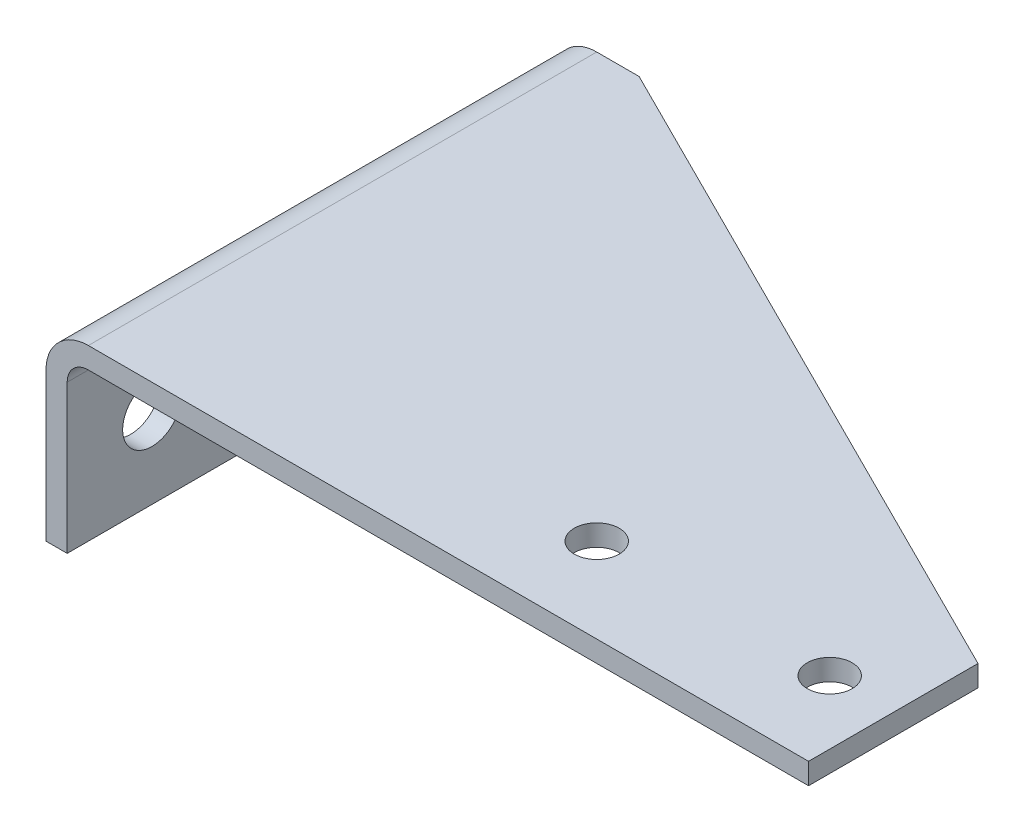
ISO-10303-21;
HEADER;
FILE_DESCRIPTION(('STEP AP214'),'2;1');
FILE_NAME('part.step','',(''),(''),'','','');
FILE_SCHEMA(('AUTOMOTIVE_DESIGN { 1 0 10303 214 1 1 1 1 }'));
ENDSEC;
DATA;
#1=APPLICATION_CONTEXT('core data for automotive mechanical design processes');
#2=APPLICATION_PROTOCOL_DEFINITION('international standard','automotive_design',2000,#1);
#3=PRODUCT_CONTEXT('',#1,'mechanical');
#4=PRODUCT('Part','Part','',(#3));
#5=PRODUCT_RELATED_PRODUCT_CATEGORY('part','',(#4));
#6=PRODUCT_DEFINITION_FORMATION('','',#4);
#7=PRODUCT_DEFINITION_CONTEXT('part definition',#1,'design');
#8=PRODUCT_DEFINITION('design','',#6,#7);
#9=PRODUCT_DEFINITION_SHAPE('','',#8);
#10=(LENGTH_UNIT() NAMED_UNIT(*) SI_UNIT(.MILLI.,.METRE.));
#11=(NAMED_UNIT(*) PLANE_ANGLE_UNIT() SI_UNIT($,.RADIAN.));
#12=(NAMED_UNIT(*) SI_UNIT($,.STERADIAN.) SOLID_ANGLE_UNIT());
#13=UNCERTAINTY_MEASURE_WITH_UNIT(LENGTH_MEASURE(1.E-05),#10,'distance_accuracy_value','');
#14=(GEOMETRIC_REPRESENTATION_CONTEXT(3) GLOBAL_UNCERTAINTY_ASSIGNED_CONTEXT((#13)) GLOBAL_UNIT_ASSIGNED_CONTEXT((#10,
#11,#12)) REPRESENTATION_CONTEXT('',''));
#15=CARTESIAN_POINT('',(0.,0.,0.));
#16=DIRECTION('',(0.,0.,1.));
#17=DIRECTION('',(1.,0.,0.));
#18=AXIS2_PLACEMENT_3D('',#15,#16,#17);
#19=CARTESIAN_POINT('',(6.34999999999998,-57.15,-127.));
#20=DIRECTION('',(1.,0.,0.));
#21=DIRECTION('',(0.,0.,-1.));
#22=AXIS2_PLACEMENT_3D('',#19,#20,#21);
#23=PLANE('',#22);
#24=CARTESIAN_POINT('',(6.34999999999997,-33.3375,0.));
#25=DIRECTION('',(1.,0.,0.));
#26=DIRECTION('',(0.,0.,-1.));
#27=AXIS2_PLACEMENT_3D('',#24,#25,#26);
#28=CIRCLE('',#27,8.763);
#29=CARTESIAN_POINT('',(6.34999999999997,-33.3375,-8.763));
#30=VERTEX_POINT('',#29);
#31=EDGE_CURVE('E149',#30,#30,#28,.F.);
#32=ORIENTED_EDGE('',*,*,#31,.T.);
#33=EDGE_LOOP('',(#32));
#34=FACE_BOUND('',#33,.T.);
#35=CARTESIAN_POINT('',(6.34999999999997,-33.3375,-101.6));
#36=DIRECTION('',(1.,0.,0.));
#37=DIRECTION('',(0.,0.,-1.));
#38=AXIS2_PLACEMENT_3D('',#35,#36,#37);
#39=CIRCLE('',#38,8.76299999999999);
#40=CARTESIAN_POINT('',(6.34999999999997,-33.3375,-110.363));
#41=VERTEX_POINT('',#40);
#42=EDGE_CURVE('E213',#41,#41,#39,.F.);
#43=ORIENTED_EDGE('',*,*,#42,.T.);
#44=EDGE_LOOP('',(#43));
#45=FACE_BOUND('',#44,.T.);
#46=DIRECTION('',(0.,0.,1.));
#47=VECTOR('',#46,1.);
#48=CARTESIAN_POINT('',(6.34999999999998,-12.7,-127.));
#49=LINE('',#48,#47);
#50=CARTESIAN_POINT('',(6.34999999999998,-12.7,-127.));
#51=VERTEX_POINT('',#50);
#52=CARTESIAN_POINT('',(6.34999999999998,-12.7,25.4000000000001));
#53=VERTEX_POINT('',#52);
#54=EDGE_CURVE('E174',#51,#53,#49,.T.);
#55=ORIENTED_EDGE('',*,*,#54,.T.);
#56=DIRECTION('',(0.,-1.,0.));
#57=VECTOR('',#56,1.);
#58=CARTESIAN_POINT('',(6.34999999999998,-57.15,25.4000000000001));
#59=LINE('',#58,#57);
#60=CARTESIAN_POINT('',(6.34999999999998,-57.15,25.4000000000001));
#61=VERTEX_POINT('',#60);
#62=EDGE_CURVE('E201',#53,#61,#59,.T.);
#63=ORIENTED_EDGE('',*,*,#62,.T.);
#64=DIRECTION('',(0.,0.,1.));
#65=VECTOR('',#64,1.);
#66=CARTESIAN_POINT('',(6.34999999999998,-57.15,-127.));
#67=LINE('',#66,#65);
#68=CARTESIAN_POINT('',(6.34999999999998,-57.15,-127.));
#69=VERTEX_POINT('',#68);
#70=EDGE_CURVE('E177',#69,#61,#67,.T.);
#71=ORIENTED_EDGE('',*,*,#70,.F.);
#72=DIRECTION('',(0.,1.,0.));
#73=VECTOR('',#72,1.);
#74=CARTESIAN_POINT('',(6.34999999999998,-57.15,-127.));
#75=LINE('',#74,#73);
#76=EDGE_CURVE('E168',#69,#51,#75,.T.);
#77=ORIENTED_EDGE('',*,*,#76,.T.);
#78=EDGE_LOOP('',(#55,#63,#71,#77));
#79=FACE_BOUND('',#78,.T.);
#80=ADVANCED_FACE('F32',(#34,#45,#79),#23,.T.);
#81=CARTESIAN_POINT('',(0.,-12.7,-127.));
#82=DIRECTION('',(-1.,0.,0.));
#83=DIRECTION('',(0.,-1.,0.));
#84=AXIS2_PLACEMENT_3D('',#81,#82,#83);
#85=PLANE('',#84);
#86=CARTESIAN_POINT('',(0.,-33.3375,0.));
#87=DIRECTION('',(1.,0.,0.));
#88=DIRECTION('',(0.,0.,-1.));
#89=AXIS2_PLACEMENT_3D('',#86,#87,#88);
#90=CIRCLE('',#89,8.763);
#91=CARTESIAN_POINT('',(0.,-33.3375,-8.763));
#92=VERTEX_POINT('',#91);
#93=EDGE_CURVE('E215',#92,#92,#90,.T.);
#94=ORIENTED_EDGE('',*,*,#93,.T.);
#95=EDGE_LOOP('',(#94));
#96=FACE_BOUND('',#95,.T.);
#97=CARTESIAN_POINT('',(0.,-33.3375,-101.6));
#98=DIRECTION('',(1.,0.,0.));
#99=DIRECTION('',(0.,0.,-1.));
#100=AXIS2_PLACEMENT_3D('',#97,#98,#99);
#101=CIRCLE('',#100,8.76299999999999);
#102=CARTESIAN_POINT('',(0.,-33.3375,-110.363));
#103=VERTEX_POINT('',#102);
#104=EDGE_CURVE('E210',#103,#103,#101,.T.);
#105=ORIENTED_EDGE('',*,*,#104,.T.);
#106=EDGE_LOOP('',(#105));
#107=FACE_BOUND('',#106,.T.);
#108=DIRECTION('',(0.,0.,1.));
#109=VECTOR('',#108,1.);
#110=CARTESIAN_POINT('',(0.,-57.15,-127.));
#111=LINE('',#110,#109);
#112=CARTESIAN_POINT('',(0.,-57.15,-127.));
#113=VERTEX_POINT('',#112);
#114=CARTESIAN_POINT('',(0.,-57.15,25.4));
#115=VERTEX_POINT('',#114);
#116=EDGE_CURVE('E180',#113,#115,#111,.T.);
#117=ORIENTED_EDGE('',*,*,#116,.T.);
#118=DIRECTION('',(0.,-1.,0.));
#119=VECTOR('',#118,1.);
#120=CARTESIAN_POINT('',(0.,504.522513486094,25.4));
#121=LINE('',#120,#119);
#122=CARTESIAN_POINT('',(0.,-12.7,25.4000000000001));
#123=VERTEX_POINT('',#122);
#124=EDGE_CURVE('E190',#123,#115,#121,.T.);
#125=ORIENTED_EDGE('',*,*,#124,.F.);
#126=DIRECTION('',(0.,0.,1.));
#127=VECTOR('',#126,1.);
#128=CARTESIAN_POINT('',(0.,-12.7,-127.));
#129=LINE('',#128,#127);
#130=CARTESIAN_POINT('',(0.,-12.7,-127.));
#131=VERTEX_POINT('',#130);
#132=EDGE_CURVE('E132',#131,#123,#129,.T.);
#133=ORIENTED_EDGE('',*,*,#132,.F.);
#134=DIRECTION('',(0.,-1.,0.));
#135=VECTOR('',#134,1.);
#136=CARTESIAN_POINT('',(0.,-12.7,-127.));
#137=LINE('',#136,#135);
#138=EDGE_CURVE('E162',#131,#113,#137,.T.);
#139=ORIENTED_EDGE('',*,*,#138,.T.);
#140=EDGE_LOOP('',(#117,#125,#133,#139));
#141=FACE_BOUND('',#140,.T.);
#142=ADVANCED_FACE('F189',(#96,#107,#141),#85,.T.);
#143=CARTESIAN_POINT('',(12.7,-6.35,-127.));
#144=DIRECTION('',(0.,-1.,0.));
#145=DIRECTION('',(1.,0.,0.));
#146=AXIS2_PLACEMENT_3D('',#143,#144,#145);
#147=PLANE('',#146);
#148=CARTESIAN_POINT('',(139.7,-6.34999999999997,0.));
#149=DIRECTION('',(0.,-1.,0.));
#150=DIRECTION('',(1.,0.,0.));
#151=AXIS2_PLACEMENT_3D('',#148,#149,#150);
#152=CIRCLE('',#151,6.73099999999998);
#153=CARTESIAN_POINT('',(146.431,-6.34999999999997,0.));
#154=VERTEX_POINT('',#153);
#155=EDGE_CURVE('E139',#154,#154,#152,.F.);
#156=ORIENTED_EDGE('',*,*,#155,.T.);
#157=EDGE_LOOP('',(#156));
#158=FACE_BOUND('',#157,.T.);
#159=CARTESIAN_POINT('',(209.55,-6.34999999999997,0.));
#160=DIRECTION('',(0.,-1.,0.));
#161=DIRECTION('',(1.,0.,0.));
#162=AXIS2_PLACEMENT_3D('',#159,#160,#161);
#163=CIRCLE('',#162,6.73099999999998);
#164=CARTESIAN_POINT('',(216.281,-6.34999999999997,0.));
#165=VERTEX_POINT('',#164);
#166=EDGE_CURVE('E116',#165,#165,#163,.F.);
#167=ORIENTED_EDGE('',*,*,#166,.T.);
#168=EDGE_LOOP('',(#167));
#169=FACE_BOUND('',#168,.T.);
#170=DIRECTION('',(0.,0.,1.));
#171=VECTOR('',#170,1.);
#172=CARTESIAN_POINT('',(228.6,-6.34999999999999,-127.));
#173=LINE('',#172,#171);
#174=CARTESIAN_POINT('',(228.6,-6.34999999999997,-25.4));
#175=VERTEX_POINT('',#174);
#176=CARTESIAN_POINT('',(228.6,-6.34999999999997,25.4));
#177=VERTEX_POINT('',#176);
#178=EDGE_CURVE('E41',#175,#177,#173,.T.);
#179=ORIENTED_EDGE('',*,*,#178,.T.);
#180=DIRECTION('',(-1.,0.,0.));
#181=VECTOR('',#180,1.);
#182=CARTESIAN_POINT('',(12.7,-6.35,25.4000000000001));
#183=LINE('',#182,#181);
#184=CARTESIAN_POINT('',(12.7,-6.35,25.4000000000001));
#185=VERTEX_POINT('',#184);
#186=EDGE_CURVE('E110',#177,#185,#183,.T.);
#187=ORIENTED_EDGE('',*,*,#186,.T.);
#188=DIRECTION('',(0.,0.,1.));
#189=VECTOR('',#188,1.);
#190=CARTESIAN_POINT('',(12.7,-6.35,-127.));
#191=LINE('',#190,#189);
#192=CARTESIAN_POINT('',(12.7,-6.35,-127.));
#193=VERTEX_POINT('',#192);
#194=EDGE_CURVE('E56',#193,#185,#191,.T.);
#195=ORIENTED_EDGE('',*,*,#194,.F.);
#196=DIRECTION('',(1.,0.,0.));
#197=VECTOR('',#196,1.);
#198=CARTESIAN_POINT('',(12.7,-6.35,-127.));
#199=LINE('',#198,#197);
#200=CARTESIAN_POINT('',(25.4,-6.35,-127.));
#201=VERTEX_POINT('',#200);
#202=EDGE_CURVE('E130',#193,#201,#199,.T.);
#203=ORIENTED_EDGE('',*,*,#202,.T.);
#204=DIRECTION('',(0.894427190999916,0.,0.447213595499958));
#205=VECTOR('',#204,1.);
#206=CARTESIAN_POINT('',(15.24,-6.35,-132.08));
#207=LINE('',#206,#205);
#208=EDGE_CURVE('E48',#201,#175,#207,.T.);
#209=ORIENTED_EDGE('',*,*,#208,.T.);
#210=EDGE_LOOP('',(#179,#187,#195,#203,#209));
#211=FACE_BOUND('',#210,.T.);
#212=ADVANCED_FACE('F244',(#158,#169,#211),#147,.T.);
#213=CARTESIAN_POINT('',(228.6,0.,-127.));
#214=DIRECTION('',(0.,1.,0.));
#215=DIRECTION('',(-1.,0.,0.));
#216=AXIS2_PLACEMENT_3D('',#213,#214,#215);
#217=PLANE('',#216);
#218=CARTESIAN_POINT('',(139.7,0.,0.));
#219=DIRECTION('',(0.,1.,0.));
#220=DIRECTION('',(-1.,0.,0.));
#221=AXIS2_PLACEMENT_3D('',#218,#219,#220);
#222=CIRCLE('',#221,6.73099999999998);
#223=CARTESIAN_POINT('',(132.969,0.,0.));
#224=VERTEX_POINT('',#223);
#225=EDGE_CURVE('E36',#224,#224,#222,.F.);
#226=ORIENTED_EDGE('',*,*,#225,.T.);
#227=EDGE_LOOP('',(#226));
#228=FACE_BOUND('',#227,.T.);
#229=CARTESIAN_POINT('',(209.55,0.,0.));
#230=DIRECTION('',(0.,1.,0.));
#231=DIRECTION('',(-1.,0.,0.));
#232=AXIS2_PLACEMENT_3D('',#229,#230,#231);
#233=CIRCLE('',#232,6.73099999999998);
#234=CARTESIAN_POINT('',(202.819,0.,0.));
#235=VERTEX_POINT('',#234);
#236=EDGE_CURVE('E137',#235,#235,#233,.F.);
#237=ORIENTED_EDGE('',*,*,#236,.T.);
#238=EDGE_LOOP('',(#237));
#239=FACE_BOUND('',#238,.T.);
#240=DIRECTION('',(0.,0.,1.));
#241=VECTOR('',#240,1.);
#242=CARTESIAN_POINT('',(12.7,0.,-127.));
#243=LINE('',#242,#241);
#244=CARTESIAN_POINT('',(12.7,0.,-127.));
#245=VERTEX_POINT('',#244);
#246=CARTESIAN_POINT('',(12.7,0.,25.4000000000001));
#247=VERTEX_POINT('',#246);
#248=EDGE_CURVE('E125',#245,#247,#243,.T.);
#249=ORIENTED_EDGE('',*,*,#248,.T.);
#250=DIRECTION('',(1.,0.,0.));
#251=VECTOR('',#250,1.);
#252=CARTESIAN_POINT('',(228.6,0.,25.4));
#253=LINE('',#252,#251);
#254=CARTESIAN_POINT('',(228.6,0.,25.4));
#255=VERTEX_POINT('',#254);
#256=EDGE_CURVE('E108',#247,#255,#253,.T.);
#257=ORIENTED_EDGE('',*,*,#256,.T.);
#258=DIRECTION('',(0.,0.,1.));
#259=VECTOR('',#258,1.);
#260=CARTESIAN_POINT('',(228.6,0.,-127.));
#261=LINE('',#260,#259);
#262=CARTESIAN_POINT('',(228.6,0.,-25.4));
#263=VERTEX_POINT('',#262);
#264=EDGE_CURVE('E123',#263,#255,#261,.T.);
#265=ORIENTED_EDGE('',*,*,#264,.F.);
#266=DIRECTION('',(-0.894427190999916,0.,-0.447213595499958));
#267=VECTOR('',#266,1.);
#268=CARTESIAN_POINT('',(187.96,0.,-45.72));
#269=LINE('',#268,#267);
#270=CARTESIAN_POINT('',(25.4,0.,-127.));
#271=VERTEX_POINT('',#270);
#272=EDGE_CURVE('E154',#263,#271,#269,.T.);
#273=ORIENTED_EDGE('',*,*,#272,.T.);
#274=DIRECTION('',(-1.,0.,0.));
#275=VECTOR('',#274,1.);
#276=CARTESIAN_POINT('',(228.6,0.,-127.));
#277=LINE('',#276,#275);
#278=EDGE_CURVE('E157',#271,#245,#277,.T.);
#279=ORIENTED_EDGE('',*,*,#278,.T.);
#280=EDGE_LOOP('',(#249,#257,#265,#273,#279));
#281=FACE_BOUND('',#280,.T.);
#282=ADVANCED_FACE('F121',(#228,#239,#281),#217,.T.);
#283=CARTESIAN_POINT('',(12.7,-12.7,-127.));
#284=DIRECTION('',(0.,0.,1.));
#285=DIRECTION('',(1.,0.,0.));
#286=AXIS2_PLACEMENT_3D('',#283,#284,#285);
#287=CYLINDRICAL_SURFACE('',#286,6.35);
#288=ORIENTED_EDGE('',*,*,#194,.T.);
#289=CARTESIAN_POINT('',(12.7,-12.7,25.4000000000001));
#290=DIRECTION('',(0.,0.,1.));
#291=DIRECTION('',(1.,0.,0.));
#292=AXIS2_PLACEMENT_3D('',#289,#290,#291);
#293=CIRCLE('',#292,6.35);
#294=EDGE_CURVE('E203',#185,#53,#293,.T.);
#295=ORIENTED_EDGE('',*,*,#294,.T.);
#296=ORIENTED_EDGE('',*,*,#54,.F.);
#297=CARTESIAN_POINT('',(12.7,-12.7,-127.));
#298=DIRECTION('',(0.,0.,-1.));
#299=DIRECTION('',(-1.,0.,0.));
#300=AXIS2_PLACEMENT_3D('',#297,#298,#299);
#301=CIRCLE('',#300,6.35);
#302=EDGE_CURVE('E134',#51,#193,#301,.T.);
#303=ORIENTED_EDGE('',*,*,#302,.T.);
#304=EDGE_LOOP('',(#288,#295,#296,#303));
#305=FACE_BOUND('',#304,.T.);
#306=ADVANCED_FACE('F248',(#305),#287,.F.);
#307=CARTESIAN_POINT('',(0.,-57.15,-127.));
#308=DIRECTION('',(0.,-1.,0.));
#309=DIRECTION('',(0.,0.,-1.));
#310=AXIS2_PLACEMENT_3D('',#307,#308,#309);
#311=PLANE('',#310);
#312=ORIENTED_EDGE('',*,*,#70,.T.);
#313=DIRECTION('',(-1.,0.,0.));
#314=VECTOR('',#313,1.);
#315=CARTESIAN_POINT('',(0.,-57.15,25.4000000000001));
#316=LINE('',#315,#314);
#317=EDGE_CURVE('E126',#61,#115,#316,.T.);
#318=ORIENTED_EDGE('',*,*,#317,.T.);
#319=ORIENTED_EDGE('',*,*,#116,.F.);
#320=DIRECTION('',(1.,0.,0.));
#321=VECTOR('',#320,1.);
#322=CARTESIAN_POINT('',(0.,-57.15,-127.));
#323=LINE('',#322,#321);
#324=EDGE_CURVE('E165',#113,#69,#323,.T.);
#325=ORIENTED_EDGE('',*,*,#324,.T.);
#326=EDGE_LOOP('',(#312,#318,#319,#325));
#327=FACE_BOUND('',#326,.T.);
#328=ADVANCED_FACE('F198',(#327),#311,.T.);
#329=CARTESIAN_POINT('',(12.7,-12.7,-127.));
#330=DIRECTION('',(0.,0.,1.));
#331=DIRECTION('',(1.,0.,0.));
#332=AXIS2_PLACEMENT_3D('',#329,#330,#331);
#333=CYLINDRICAL_SURFACE('',#332,12.7);
#334=ORIENTED_EDGE('',*,*,#132,.T.);
#335=CARTESIAN_POINT('',(12.7,-12.7,25.4000000000001));
#336=DIRECTION('',(0.,0.,1.));
#337=DIRECTION('',(1.,0.,0.));
#338=AXIS2_PLACEMENT_3D('',#335,#336,#337);
#339=CIRCLE('',#338,12.7);
#340=EDGE_CURVE('E127',#123,#247,#339,.F.);
#341=ORIENTED_EDGE('',*,*,#340,.T.);
#342=ORIENTED_EDGE('',*,*,#248,.F.);
#343=CARTESIAN_POINT('',(12.7,-12.7,-127.));
#344=DIRECTION('',(0.,0.,1.));
#345=DIRECTION('',(1.,0.,0.));
#346=AXIS2_PLACEMENT_3D('',#343,#344,#345);
#347=CIRCLE('',#346,12.7);
#348=EDGE_CURVE('E159',#245,#131,#347,.T.);
#349=ORIENTED_EDGE('',*,*,#348,.T.);
#350=EDGE_LOOP('',(#334,#341,#342,#349));
#351=FACE_BOUND('',#350,.T.);
#352=ADVANCED_FACE('F184',(#351),#333,.T.);
#353=CARTESIAN_POINT('',(228.6,-6.34999999999999,-127.));
#354=DIRECTION('',(1.,0.,0.));
#355=DIRECTION('',(0.,0.,-1.));
#356=AXIS2_PLACEMENT_3D('',#353,#354,#355);
#357=PLANE('',#356);
#358=ORIENTED_EDGE('',*,*,#264,.T.);
#359=DIRECTION('',(0.,-1.,0.));
#360=VECTOR('',#359,1.);
#361=CARTESIAN_POINT('',(228.6,508.,25.4));
#362=LINE('',#361,#360);
#363=EDGE_CURVE('E105',#255,#177,#362,.T.);
#364=ORIENTED_EDGE('',*,*,#363,.T.);
#365=ORIENTED_EDGE('',*,*,#178,.F.);
#366=DIRECTION('',(0.,-1.,0.));
#367=VECTOR('',#366,1.);
#368=CARTESIAN_POINT('',(228.6,508.,-25.4));
#369=LINE('',#368,#367);
#370=EDGE_CURVE('E115',#263,#175,#369,.T.);
#371=ORIENTED_EDGE('',*,*,#370,.F.);
#372=EDGE_LOOP('',(#358,#364,#365,#371));
#373=FACE_BOUND('',#372,.T.);
#374=ADVANCED_FACE('F34',(#373),#357,.T.);
#375=CARTESIAN_POINT('',(12.7,-12.7,-127.));
#376=DIRECTION('',(0.,0.,1.));
#377=DIRECTION('',(1.,0.,0.));
#378=AXIS2_PLACEMENT_3D('',#375,#376,#377);
#379=PLANE('',#378);
#380=DIRECTION('',(0.,1.,0.));
#381=VECTOR('',#380,1.);
#382=CARTESIAN_POINT('',(25.4,-12.7,-127.));
#383=LINE('',#382,#381);
#384=EDGE_CURVE('E11',#201,#271,#383,.T.);
#385=ORIENTED_EDGE('',*,*,#384,.F.);
#386=ORIENTED_EDGE('',*,*,#202,.F.);
#387=ORIENTED_EDGE('',*,*,#302,.F.);
#388=ORIENTED_EDGE('',*,*,#76,.F.);
#389=ORIENTED_EDGE('',*,*,#324,.F.);
#390=ORIENTED_EDGE('',*,*,#138,.F.);
#391=ORIENTED_EDGE('',*,*,#348,.F.);
#392=ORIENTED_EDGE('',*,*,#278,.F.);
#393=EDGE_LOOP('',(#385,#386,#387,#388,#389,#390,#391,#392));
#394=FACE_BOUND('',#393,.T.);
#395=ADVANCED_FACE('F193',(#394),#379,.F.);
#396=CARTESIAN_POINT('',(25.4,508.,-127.));
#397=DIRECTION('',(0.447213595499958,0.,-0.894427190999916));
#398=DIRECTION('',(-0.894427190999916,0.,-0.447213595499958));
#399=AXIS2_PLACEMENT_3D('',#396,#397,#398);
#400=PLANE('',#399);
#401=ORIENTED_EDGE('',*,*,#384,.T.);
#402=ORIENTED_EDGE('',*,*,#272,.F.);
#403=ORIENTED_EDGE('',*,*,#370,.T.);
#404=ORIENTED_EDGE('',*,*,#208,.F.);
#405=EDGE_LOOP('',(#401,#402,#403,#404));
#406=FACE_BOUND('',#405,.T.);
#407=ADVANCED_FACE('F268',(#406),#400,.T.);
#408=CARTESIAN_POINT('',(209.55,508.,0.));
#409=DIRECTION('',(0.,-1.,0.));
#410=DIRECTION('',(0.,0.,-1.));
#411=AXIS2_PLACEMENT_3D('',#408,#409,#410);
#412=CYLINDRICAL_SURFACE('',#411,6.73099999999998);
#413=ORIENTED_EDGE('',*,*,#166,.F.);
#414=EDGE_LOOP('',(#413));
#415=FACE_BOUND('',#414,.T.);
#416=ORIENTED_EDGE('',*,*,#236,.F.);
#417=EDGE_LOOP('',(#416));
#418=FACE_BOUND('',#417,.T.);
#419=ADVANCED_FACE('F236',(#415,#418),#412,.F.);
#420=CARTESIAN_POINT('',(139.7,508.,0.));
#421=DIRECTION('',(0.,-1.,0.));
#422=DIRECTION('',(0.,0.,-1.));
#423=AXIS2_PLACEMENT_3D('',#420,#421,#422);
#424=CYLINDRICAL_SURFACE('',#423,6.73099999999998);
#425=ORIENTED_EDGE('',*,*,#155,.F.);
#426=EDGE_LOOP('',(#425));
#427=FACE_BOUND('',#426,.T.);
#428=ORIENTED_EDGE('',*,*,#225,.F.);
#429=EDGE_LOOP('',(#428));
#430=FACE_BOUND('',#429,.T.);
#431=ADVANCED_FACE('F228',(#427,#430),#424,.F.);
#432=CARTESIAN_POINT('',(228.6,-33.3375,0.));
#433=DIRECTION('',(-1.,0.,0.));
#434=DIRECTION('',(0.,0.,1.));
#435=AXIS2_PLACEMENT_3D('',#432,#433,#434);
#436=CYLINDRICAL_SURFACE('',#435,8.763);
#437=ORIENTED_EDGE('',*,*,#31,.F.);
#438=EDGE_LOOP('',(#437));
#439=FACE_BOUND('',#438,.T.);
#440=ORIENTED_EDGE('',*,*,#93,.F.);
#441=EDGE_LOOP('',(#440));
#442=FACE_BOUND('',#441,.T.);
#443=ADVANCED_FACE('F224',(#439,#442),#436,.F.);
#444=CARTESIAN_POINT('',(228.6,-33.3375,-101.6));
#445=DIRECTION('',(-1.,0.,0.));
#446=DIRECTION('',(0.,0.,1.));
#447=AXIS2_PLACEMENT_3D('',#444,#445,#446);
#448=CYLINDRICAL_SURFACE('',#447,8.76299999999999);
#449=ORIENTED_EDGE('',*,*,#42,.F.);
#450=EDGE_LOOP('',(#449));
#451=FACE_BOUND('',#450,.T.);
#452=ORIENTED_EDGE('',*,*,#104,.F.);
#453=EDGE_LOOP('',(#452));
#454=FACE_BOUND('',#453,.T.);
#455=ADVANCED_FACE('F227',(#451,#454),#448,.F.);
#456=CARTESIAN_POINT('',(228.6,504.522513486094,25.4));
#457=DIRECTION('',(0.,0.,1.));
#458=DIRECTION('',(1.,0.,0.));
#459=AXIS2_PLACEMENT_3D('',#456,#457,#458);
#460=PLANE('',#459);
#461=ORIENTED_EDGE('',*,*,#186,.F.);
#462=ORIENTED_EDGE('',*,*,#363,.F.);
#463=ORIENTED_EDGE('',*,*,#256,.F.);
#464=ORIENTED_EDGE('',*,*,#340,.F.);
#465=ORIENTED_EDGE('',*,*,#124,.T.);
#466=ORIENTED_EDGE('',*,*,#317,.F.);
#467=ORIENTED_EDGE('',*,*,#62,.F.);
#468=ORIENTED_EDGE('',*,*,#294,.F.);
#469=EDGE_LOOP('',(#461,#462,#463,#464,#465,#466,#467,#468));
#470=FACE_BOUND('',#469,.T.);
#471=ADVANCED_FACE('F107',(#470),#460,.T.);
#472=CLOSED_SHELL('',(#80,#142,#212,#282,#306,#328,#352,#374,#395,#407,#419,#431,#443,#455,#471));
#473=MANIFOLD_SOLID_BREP('B2',#472);
#474=ADVANCED_BREP_SHAPE_REPRESENTATION('',(#18,#473),#14);
#475=SHAPE_DEFINITION_REPRESENTATION(#9,#474);
ENDSEC;
END-ISO-10303-21;
